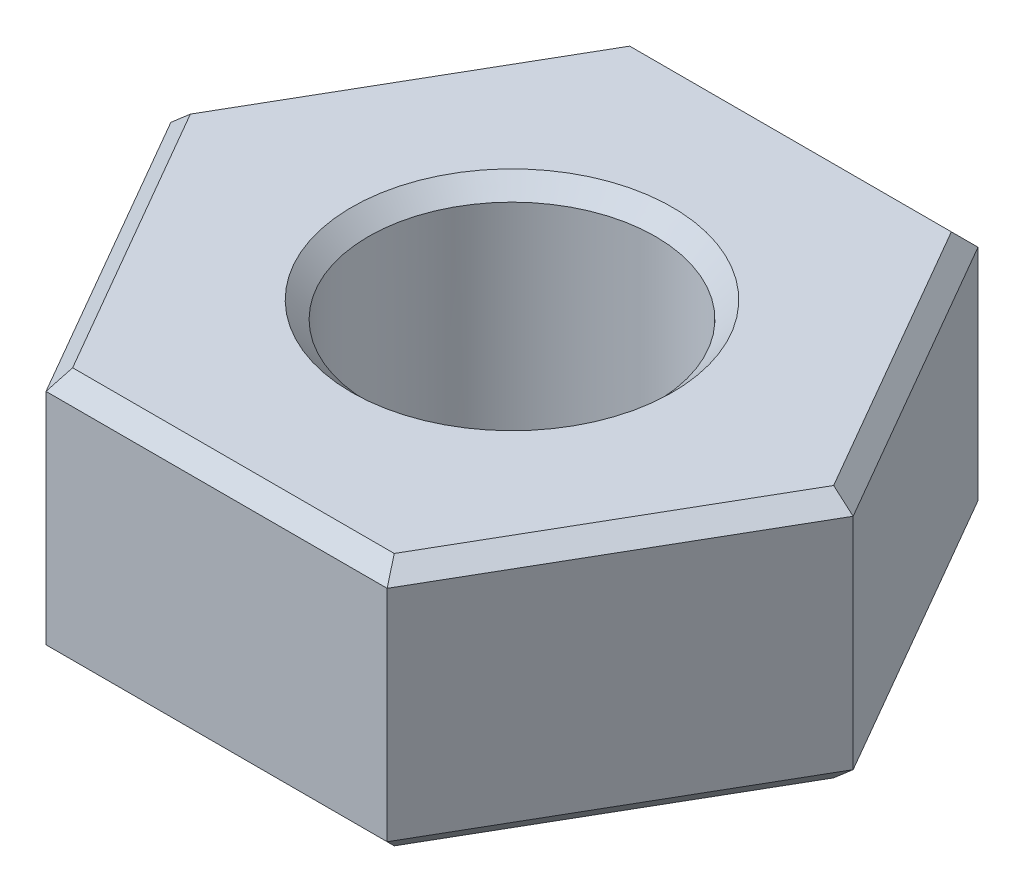
ISO-10303-21;
HEADER;
FILE_DESCRIPTION(('STEP AP214'),'2;1');
FILE_NAME('part.step','',(''),(''),'','','');
FILE_SCHEMA(('AUTOMOTIVE_DESIGN { 1 0 10303 214 1 1 1 1 }'));
ENDSEC;
DATA;
#1=APPLICATION_CONTEXT('core data for automotive mechanical design processes');
#2=APPLICATION_PROTOCOL_DEFINITION('international standard','automotive_design',2000,#1);
#3=PRODUCT_CONTEXT('',#1,'mechanical');
#4=PRODUCT('Part','Part','',(#3));
#5=PRODUCT_RELATED_PRODUCT_CATEGORY('part','',(#4));
#6=PRODUCT_DEFINITION_FORMATION('','',#4);
#7=PRODUCT_DEFINITION_CONTEXT('part definition',#1,'design');
#8=PRODUCT_DEFINITION('design','',#6,#7);
#9=PRODUCT_DEFINITION_SHAPE('','',#8);
#10=(LENGTH_UNIT() NAMED_UNIT(*) SI_UNIT(.MILLI.,.METRE.));
#11=(NAMED_UNIT(*) PLANE_ANGLE_UNIT() SI_UNIT($,.RADIAN.));
#12=(NAMED_UNIT(*) SI_UNIT($,.STERADIAN.) SOLID_ANGLE_UNIT());
#13=UNCERTAINTY_MEASURE_WITH_UNIT(LENGTH_MEASURE(1.E-05),#10,'distance_accuracy_value','');
#14=(GEOMETRIC_REPRESENTATION_CONTEXT(3) GLOBAL_UNCERTAINTY_ASSIGNED_CONTEXT((#13)) GLOBAL_UNIT_ASSIGNED_CONTEXT((#10,
#11,#12)) REPRESENTATION_CONTEXT('',''));
#15=CARTESIAN_POINT('',(0.,0.,0.));
#16=DIRECTION('',(0.,0.,1.));
#17=DIRECTION('',(1.,0.,0.));
#18=AXIS2_PLACEMENT_3D('',#15,#16,#17);
#19=CARTESIAN_POINT('',(4.04145188432738,0.,0.));
#20=DIRECTION('',(0.,1.,0.));
#21=DIRECTION('',(0.,0.,1.));
#22=AXIS2_PLACEMENT_3D('',#19,#20,#21);
#23=PLANE('',#22);
#24=CARTESIAN_POINT('',(0.,0.,0.));
#25=DIRECTION('',(0.,-1.,0.));
#26=DIRECTION('',(0.,0.,-1.));
#27=AXIS2_PLACEMENT_3D('',#24,#25,#26);
#28=CIRCLE('',#27,1.90000000003465);
#29=CARTESIAN_POINT('',(0.,0.,-1.90000000003465));
#30=VERTEX_POINT('',#29);
#31=EDGE_CURVE('E20',#30,#30,#28,.F.);
#32=ORIENTED_EDGE('',*,*,#31,.T.);
#33=EDGE_LOOP('',(#32));
#34=FACE_BOUND('',#33,.T.);
#35=DIRECTION('',(-0.5,0.,0.866025403784439));
#36=VECTOR('',#35,1.);
#37=CARTESIAN_POINT('',(3.81051177665153,0.,0.));
#38=LINE('',#37,#36);
#39=CARTESIAN_POINT('',(3.81051177665153,0.,0.));
#40=VERTEX_POINT('',#39);
#41=CARTESIAN_POINT('',(1.90525588832576,0.,3.3));
#42=VERTEX_POINT('',#41);
#43=EDGE_CURVE('E139',#40,#42,#38,.T.);
#44=ORIENTED_EDGE('',*,*,#43,.T.);
#45=DIRECTION('',(1.,0.,0.));
#46=VECTOR('',#45,1.);
#47=CARTESIAN_POINT('',(-2.02072594216369,0.,3.3));
#48=LINE('',#47,#46);
#49=CARTESIAN_POINT('',(-1.90525588832576,0.,3.3));
#50=VERTEX_POINT('',#49);
#51=EDGE_CURVE('E135',#42,#50,#48,.F.);
#52=ORIENTED_EDGE('',*,*,#51,.T.);
#53=DIRECTION('',(-0.5,0.,-0.866025403784439));
#54=VECTOR('',#53,1.);
#55=CARTESIAN_POINT('',(-1.90525588832576,0.,3.3));
#56=LINE('',#55,#54);
#57=CARTESIAN_POINT('',(-3.81051177665153,0.,0.));
#58=VERTEX_POINT('',#57);
#59=EDGE_CURVE('E112',#50,#58,#56,.T.);
#60=ORIENTED_EDGE('',*,*,#59,.T.);
#61=DIRECTION('',(0.5,0.,-0.866025403784439));
#62=VECTOR('',#61,1.);
#63=CARTESIAN_POINT('',(-3.81051177665153,0.,0.));
#64=LINE('',#63,#62);
#65=CARTESIAN_POINT('',(-1.90525588832576,0.,-3.3));
#66=VERTEX_POINT('',#65);
#67=EDGE_CURVE('E103',#58,#66,#64,.T.);
#68=ORIENTED_EDGE('',*,*,#67,.T.);
#69=DIRECTION('',(1.,0.,0.));
#70=VECTOR('',#69,1.);
#71=CARTESIAN_POINT('',(2.02072594216369,0.,-3.3));
#72=LINE('',#71,#70);
#73=CARTESIAN_POINT('',(1.90525588832576,0.,-3.3));
#74=VERTEX_POINT('',#73);
#75=EDGE_CURVE('E109',#66,#74,#72,.T.);
#76=ORIENTED_EDGE('',*,*,#75,.T.);
#77=DIRECTION('',(0.5,0.,0.866025403784439));
#78=VECTOR('',#77,1.);
#79=CARTESIAN_POINT('',(1.90525588832576,0.,-3.3));
#80=LINE('',#79,#78);
#81=EDGE_CURVE('E144',#74,#40,#80,.T.);
#82=ORIENTED_EDGE('',*,*,#81,.T.);
#83=EDGE_LOOP('',(#44,#52,#60,#68,#76,#82));
#84=FACE_BOUND('',#83,.T.);
#85=ADVANCED_FACE('F17',(#34,#84),#23,.F.);
#86=CARTESIAN_POINT('',(2.02072594216369,0.200000000000001,-3.5));
#87=DIRECTION('',(0.,0.707106781186551,0.707106781186544));
#88=DIRECTION('',(0.,-0.707106781186544,0.707106781186551));
#89=AXIS2_PLACEMENT_3D('',#86,#87,#88);
#90=PLANE('',#89);
#91=DIRECTION('',(-0.377964473009231,-0.654653670707974,0.654653670707978));
#92=VECTOR('',#91,1.);
#93=CARTESIAN_POINT('',(2.02072594216369,0.2,-3.5));
#94=LINE('',#93,#92);
#95=CARTESIAN_POINT('',(2.02072594216369,0.200000000000001,-3.5));
#96=VERTEX_POINT('',#95);
#97=EDGE_CURVE('E120',#96,#74,#94,.T.);
#98=ORIENTED_EDGE('',*,*,#97,.T.);
#99=ORIENTED_EDGE('',*,*,#75,.F.);
#100=DIRECTION('',(-0.377964473009228,0.654653670707975,-0.654653670707979));
#101=VECTOR('',#100,1.);
#102=CARTESIAN_POINT('',(-1.90525588832576,0.,-3.3));
#103=LINE('',#102,#101);
#104=CARTESIAN_POINT('',(-2.02072594216369,0.2,-3.5));
#105=VERTEX_POINT('',#104);
#106=EDGE_CURVE('E114',#66,#105,#103,.T.);
#107=ORIENTED_EDGE('',*,*,#106,.T.);
#108=DIRECTION('',(1.,0.,0.));
#109=VECTOR('',#108,1.);
#110=CARTESIAN_POINT('',(2.02072594216369,0.200000000000001,-3.5));
#111=LINE('',#110,#109);
#112=EDGE_CURVE('E151',#105,#96,#111,.T.);
#113=ORIENTED_EDGE('',*,*,#112,.T.);
#114=EDGE_LOOP('',(#98,#99,#107,#113));
#115=FACE_BOUND('',#114,.T.);
#116=ADVANCED_FACE('F117',(#115),#90,.F.);
#117=CARTESIAN_POINT('',(-2.02072594216369,0.200000000000001,-3.5));
#118=DIRECTION('',(0.612372435695792,0.70710678118655,0.353553390593272));
#119=DIRECTION('',(-0.755928946018457,0.654653670707974,0.));
#120=AXIS2_PLACEMENT_3D('',#117,#118,#119);
#121=PLANE('',#120);
#122=ORIENTED_EDGE('',*,*,#106,.F.);
#123=ORIENTED_EDGE('',*,*,#67,.F.);
#124=DIRECTION('',(-0.755928946018457,0.654653670707974,0.));
#125=VECTOR('',#124,1.);
#126=CARTESIAN_POINT('',(-4.04145188432738,0.200000000000001,0.));
#127=LINE('',#126,#125);
#128=CARTESIAN_POINT('',(-4.04145188432738,0.200000000000001,0.));
#129=VERTEX_POINT('',#128);
#130=EDGE_CURVE('E128',#58,#129,#127,.T.);
#131=ORIENTED_EDGE('',*,*,#130,.T.);
#132=DIRECTION('',(0.5,0.,-0.866025403784439));
#133=VECTOR('',#132,1.);
#134=CARTESIAN_POINT('',(-2.02072594216369,0.200000000000001,-3.5));
#135=LINE('',#134,#133);
#136=EDGE_CURVE('E126',#129,#105,#135,.T.);
#137=ORIENTED_EDGE('',*,*,#136,.T.);
#138=EDGE_LOOP('',(#122,#123,#131,#137));
#139=FACE_BOUND('',#138,.T.);
#140=ADVANCED_FACE('F124',(#139),#121,.F.);
#141=CARTESIAN_POINT('',(-4.04145188432738,0.200000000000001,0.));
#142=DIRECTION('',(0.612372435695792,0.707106781186551,-0.353553390593272));
#143=DIRECTION('',(-0.755928946018457,0.654653670707974,0.));
#144=AXIS2_PLACEMENT_3D('',#141,#142,#143);
#145=PLANE('',#144);
#146=DIRECTION('',(-0.377964473009229,0.654653670707973,0.65465367070798));
#147=VECTOR('',#146,1.);
#148=CARTESIAN_POINT('',(-1.90525588832576,0.,3.3));
#149=LINE('',#148,#147);
#150=CARTESIAN_POINT('',(-2.02072594216369,0.2,3.5));
#151=VERTEX_POINT('',#150);
#152=EDGE_CURVE('E133',#50,#151,#149,.T.);
#153=ORIENTED_EDGE('',*,*,#152,.T.);
#154=DIRECTION('',(-0.5,0.,-0.866025403784439));
#155=VECTOR('',#154,1.);
#156=CARTESIAN_POINT('',(-4.04145188432738,0.2,0.));
#157=LINE('',#156,#155);
#158=EDGE_CURVE('E158',#151,#129,#157,.T.);
#159=ORIENTED_EDGE('',*,*,#158,.T.);
#160=ORIENTED_EDGE('',*,*,#130,.F.);
#161=ORIENTED_EDGE('',*,*,#59,.F.);
#162=EDGE_LOOP('',(#153,#159,#160,#161));
#163=FACE_BOUND('',#162,.T.);
#164=ADVANCED_FACE('F298',(#163),#145,.F.);
#165=CARTESIAN_POINT('',(-2.02072594216369,0.200000000000001,3.5));
#166=DIRECTION('',(0.,0.707106781186551,-0.707106781186544));
#167=DIRECTION('',(0.,0.707106781186544,0.707106781186551));
#168=AXIS2_PLACEMENT_3D('',#165,#166,#167);
#169=PLANE('',#168);
#170=DIRECTION('',(0.37796447300923,0.654653670707973,0.65465367070798));
#171=VECTOR('',#170,1.);
#172=CARTESIAN_POINT('',(1.90525588832576,0.,3.3));
#173=LINE('',#172,#171);
#174=CARTESIAN_POINT('',(2.02072594216369,0.200000000000001,3.5));
#175=VERTEX_POINT('',#174);
#176=EDGE_CURVE('E137',#42,#175,#173,.T.);
#177=ORIENTED_EDGE('',*,*,#176,.T.);
#178=DIRECTION('',(-1.,0.,0.));
#179=VECTOR('',#178,1.);
#180=CARTESIAN_POINT('',(-2.02072594216369,0.200000000000001,3.5));
#181=LINE('',#180,#179);
#182=EDGE_CURVE('E163',#175,#151,#181,.T.);
#183=ORIENTED_EDGE('',*,*,#182,.T.);
#184=ORIENTED_EDGE('',*,*,#152,.F.);
#185=ORIENTED_EDGE('',*,*,#51,.F.);
#186=EDGE_LOOP('',(#177,#183,#184,#185));
#187=FACE_BOUND('',#186,.T.);
#188=ADVANCED_FACE('F303',(#187),#169,.F.);
#189=CARTESIAN_POINT('',(2.02072594216369,0.200000000000001,3.5));
#190=DIRECTION('',(-0.612372435695791,0.707106781186552,-0.353553390593271));
#191=DIRECTION('',(-0.755928946018458,-0.654653670707973,0.));
#192=AXIS2_PLACEMENT_3D('',#189,#190,#191);
#193=PLANE('',#192);
#194=DIRECTION('',(-0.755928946018458,-0.654653670707974,0.));
#195=VECTOR('',#194,1.);
#196=CARTESIAN_POINT('',(4.04145188432738,0.200000000000001,0.));
#197=LINE('',#196,#195);
#198=CARTESIAN_POINT('',(4.04145188432738,0.200000000000001,0.));
#199=VERTEX_POINT('',#198);
#200=EDGE_CURVE('E141',#40,#199,#197,.F.);
#201=ORIENTED_EDGE('',*,*,#200,.T.);
#202=DIRECTION('',(-0.5,0.,0.866025403784439));
#203=VECTOR('',#202,1.);
#204=CARTESIAN_POINT('',(2.02072594216369,0.200000000000001,3.5));
#205=LINE('',#204,#203);
#206=EDGE_CURVE('E168',#199,#175,#205,.T.);
#207=ORIENTED_EDGE('',*,*,#206,.T.);
#208=ORIENTED_EDGE('',*,*,#176,.F.);
#209=ORIENTED_EDGE('',*,*,#43,.F.);
#210=EDGE_LOOP('',(#201,#207,#208,#209));
#211=FACE_BOUND('',#210,.T.);
#212=ADVANCED_FACE('F307',(#211),#193,.F.);
#213=CARTESIAN_POINT('',(4.04145188432738,0.200000000000001,0.));
#214=DIRECTION('',(-0.612372435695792,0.707106781186551,0.353553390593272));
#215=DIRECTION('',(-0.755928946018458,-0.654653670707974,0.));
#216=AXIS2_PLACEMENT_3D('',#213,#214,#215);
#217=PLANE('',#216);
#218=ORIENTED_EDGE('',*,*,#97,.F.);
#219=DIRECTION('',(0.5,0.,0.866025403784438));
#220=VECTOR('',#219,1.);
#221=CARTESIAN_POINT('',(4.04145188432738,0.200000000000001,0.));
#222=LINE('',#221,#220);
#223=EDGE_CURVE('E150',#96,#199,#222,.T.);
#224=ORIENTED_EDGE('',*,*,#223,.T.);
#225=ORIENTED_EDGE('',*,*,#200,.F.);
#226=ORIENTED_EDGE('',*,*,#81,.F.);
#227=EDGE_LOOP('',(#218,#224,#225,#226));
#228=FACE_BOUND('',#227,.T.);
#229=ADVANCED_FACE('F286',(#228),#217,.F.);
#230=CARTESIAN_POINT('',(0.,0.,0.));
#231=DIRECTION('',(0.,-1.,0.));
#232=DIRECTION('',(0.,0.,-1.));
#233=AXIS2_PLACEMENT_3D('',#230,#231,#232);
#234=CONICAL_SURFACE('',#233,1.90000000003465,0.785398163539557);
#235=CARTESIAN_POINT('',(0.,0.200000000000002,0.));
#236=DIRECTION('',(0.,-1.,0.));
#237=DIRECTION('',(0.,0.,-1.));
#238=AXIS2_PLACEMENT_3D('',#235,#236,#237);
#239=CIRCLE('',#238,1.7);
#240=CARTESIAN_POINT('',(0.,0.200000000000002,-1.7));
#241=VERTEX_POINT('',#240);
#242=EDGE_CURVE('E146',#241,#241,#239,.F.);
#243=ORIENTED_EDGE('',*,*,#242,.T.);
#244=EDGE_LOOP('',(#243));
#245=FACE_BOUND('',#244,.T.);
#246=ORIENTED_EDGE('',*,*,#31,.F.);
#247=EDGE_LOOP('',(#246));
#248=FACE_BOUND('',#247,.T.);
#249=ADVANCED_FACE('F282',(#245,#248),#234,.F.);
#250=CARTESIAN_POINT('',(2.02072594216369,3.,-3.5));
#251=DIRECTION('',(0.,0.,1.));
#252=DIRECTION('',(1.,0.,0.));
#253=AXIS2_PLACEMENT_3D('',#250,#251,#252);
#254=PLANE('',#253);
#255=DIRECTION('',(0.,1.,0.));
#256=VECTOR('',#255,1.);
#257=CARTESIAN_POINT('',(-2.02072594216369,3.,-3.5));
#258=LINE('',#257,#256);
#259=CARTESIAN_POINT('',(-2.02072594216369,2.8,-3.5));
#260=VERTEX_POINT('',#259);
#261=EDGE_CURVE('E153',#105,#260,#258,.T.);
#262=ORIENTED_EDGE('',*,*,#261,.T.);
#263=DIRECTION('',(1.,0.,0.));
#264=VECTOR('',#263,1.);
#265=CARTESIAN_POINT('',(4.04145188432738,2.8,-3.5));
#266=LINE('',#265,#264);
#267=CARTESIAN_POINT('',(2.02072594216369,2.8,-3.5));
#268=VERTEX_POINT('',#267);
#269=EDGE_CURVE('E149',#268,#260,#266,.F.);
#270=ORIENTED_EDGE('',*,*,#269,.F.);
#271=DIRECTION('',(0.,1.,0.));
#272=VECTOR('',#271,1.);
#273=CARTESIAN_POINT('',(2.02072594216369,3.,-3.5));
#274=LINE('',#273,#272);
#275=EDGE_CURVE('E173',#268,#96,#274,.F.);
#276=ORIENTED_EDGE('',*,*,#275,.T.);
#277=ORIENTED_EDGE('',*,*,#112,.F.);
#278=EDGE_LOOP('',(#262,#270,#276,#277));
#279=FACE_BOUND('',#278,.T.);
#280=ADVANCED_FACE('F285',(#279),#254,.F.);
#281=CARTESIAN_POINT('',(-2.02072594216369,3.,-3.5));
#282=DIRECTION('',(0.866025403784439,0.,0.5));
#283=DIRECTION('',(0.5,0.,-0.866025403784439));
#284=AXIS2_PLACEMENT_3D('',#281,#282,#283);
#285=PLANE('',#284);
#286=DIRECTION('',(0.,1.,0.));
#287=VECTOR('',#286,1.);
#288=CARTESIAN_POINT('',(-4.04145188432738,3.,0.));
#289=LINE('',#288,#287);
#290=CARTESIAN_POINT('',(-4.04145188432738,2.8,0.));
#291=VERTEX_POINT('',#290);
#292=EDGE_CURVE('E156',#129,#291,#289,.T.);
#293=ORIENTED_EDGE('',*,*,#292,.T.);
#294=DIRECTION('',(-0.5,0.,0.866025403784439));
#295=VECTOR('',#294,1.);
#296=CARTESIAN_POINT('',(-2.02072594216369,2.8,-3.5));
#297=LINE('',#296,#295);
#298=EDGE_CURVE('E188',#260,#291,#297,.T.);
#299=ORIENTED_EDGE('',*,*,#298,.F.);
#300=ORIENTED_EDGE('',*,*,#261,.F.);
#301=ORIENTED_EDGE('',*,*,#136,.F.);
#302=EDGE_LOOP('',(#293,#299,#300,#301));
#303=FACE_BOUND('',#302,.T.);
#304=ADVANCED_FACE('F317',(#303),#285,.F.);
#305=CARTESIAN_POINT('',(-4.04145188432738,3.,0.));
#306=DIRECTION('',(0.866025403784439,0.,-0.5));
#307=DIRECTION('',(-0.5,0.,-0.866025403784439));
#308=AXIS2_PLACEMENT_3D('',#305,#306,#307);
#309=PLANE('',#308);
#310=DIRECTION('',(0.,1.,0.));
#311=VECTOR('',#310,1.);
#312=CARTESIAN_POINT('',(-2.02072594216369,3.,3.5));
#313=LINE('',#312,#311);
#314=CARTESIAN_POINT('',(-2.02072594216369,2.8,3.5));
#315=VERTEX_POINT('',#314);
#316=EDGE_CURVE('E161',#151,#315,#313,.T.);
#317=ORIENTED_EDGE('',*,*,#316,.T.);
#318=DIRECTION('',(0.5,0.,0.866025403784438));
#319=VECTOR('',#318,1.);
#320=CARTESIAN_POINT('',(-4.04145188432738,2.8,0.));
#321=LINE('',#320,#319);
#322=EDGE_CURVE('E194',#291,#315,#321,.T.);
#323=ORIENTED_EDGE('',*,*,#322,.F.);
#324=ORIENTED_EDGE('',*,*,#292,.F.);
#325=ORIENTED_EDGE('',*,*,#158,.F.);
#326=EDGE_LOOP('',(#317,#323,#324,#325));
#327=FACE_BOUND('',#326,.T.);
#328=ADVANCED_FACE('F321',(#327),#309,.F.);
#329=CARTESIAN_POINT('',(-2.02072594216369,3.,3.5));
#330=DIRECTION('',(0.,0.,-1.));
#331=DIRECTION('',(-1.,0.,0.));
#332=AXIS2_PLACEMENT_3D('',#329,#330,#331);
#333=PLANE('',#332);
#334=DIRECTION('',(0.,1.,0.));
#335=VECTOR('',#334,1.);
#336=CARTESIAN_POINT('',(2.02072594216369,3.,3.5));
#337=LINE('',#336,#335);
#338=CARTESIAN_POINT('',(2.02072594216369,2.8,3.5));
#339=VERTEX_POINT('',#338);
#340=EDGE_CURVE('E166',#175,#339,#337,.T.);
#341=ORIENTED_EDGE('',*,*,#340,.T.);
#342=DIRECTION('',(1.,0.,0.));
#343=VECTOR('',#342,1.);
#344=CARTESIAN_POINT('',(4.04145188432738,2.8,3.5));
#345=LINE('',#344,#343);
#346=EDGE_CURVE('E200',#315,#339,#345,.T.);
#347=ORIENTED_EDGE('',*,*,#346,.F.);
#348=ORIENTED_EDGE('',*,*,#316,.F.);
#349=ORIENTED_EDGE('',*,*,#182,.F.);
#350=EDGE_LOOP('',(#341,#347,#348,#349));
#351=FACE_BOUND('',#350,.T.);
#352=ADVANCED_FACE('F325',(#351),#333,.F.);
#353=CARTESIAN_POINT('',(2.02072594216369,3.,3.5));
#354=DIRECTION('',(-0.866025403784439,0.,-0.5));
#355=DIRECTION('',(-0.5,0.,0.866025403784439));
#356=AXIS2_PLACEMENT_3D('',#353,#354,#355);
#357=PLANE('',#356);
#358=DIRECTION('',(0.,1.,0.));
#359=VECTOR('',#358,1.);
#360=CARTESIAN_POINT('',(4.04145188432738,3.,0.));
#361=LINE('',#360,#359);
#362=CARTESIAN_POINT('',(4.04145188432738,2.8,0.));
#363=VERTEX_POINT('',#362);
#364=EDGE_CURVE('E171',#199,#363,#361,.T.);
#365=ORIENTED_EDGE('',*,*,#364,.T.);
#366=DIRECTION('',(0.5,0.,-0.866025403784439));
#367=VECTOR('',#366,1.);
#368=CARTESIAN_POINT('',(2.02072594216369,2.8,3.5));
#369=LINE('',#368,#367);
#370=EDGE_CURVE('E206',#339,#363,#369,.T.);
#371=ORIENTED_EDGE('',*,*,#370,.F.);
#372=ORIENTED_EDGE('',*,*,#340,.F.);
#373=ORIENTED_EDGE('',*,*,#206,.F.);
#374=EDGE_LOOP('',(#365,#371,#372,#373));
#375=FACE_BOUND('',#374,.T.);
#376=ADVANCED_FACE('F329',(#375),#357,.F.);
#377=CARTESIAN_POINT('',(4.04145188432738,3.,0.));
#378=DIRECTION('',(-0.866025403784438,0.,0.5));
#379=DIRECTION('',(0.5,0.,0.866025403784438));
#380=AXIS2_PLACEMENT_3D('',#377,#378,#379);
#381=PLANE('',#380);
#382=ORIENTED_EDGE('',*,*,#275,.F.);
#383=DIRECTION('',(-0.5,0.,-0.866025403784438));
#384=VECTOR('',#383,1.);
#385=CARTESIAN_POINT('',(4.04145188432738,2.8,0.));
#386=LINE('',#385,#384);
#387=EDGE_CURVE('E209',#363,#268,#386,.T.);
#388=ORIENTED_EDGE('',*,*,#387,.F.);
#389=ORIENTED_EDGE('',*,*,#364,.F.);
#390=ORIENTED_EDGE('',*,*,#223,.F.);
#391=EDGE_LOOP('',(#382,#388,#389,#390));
#392=FACE_BOUND('',#391,.T.);
#393=ADVANCED_FACE('F278',(#392),#381,.F.);
#394=CARTESIAN_POINT('',(0.,3.,0.));
#395=DIRECTION('',(0.,-1.,0.));
#396=DIRECTION('',(0.,0.,-1.));
#397=AXIS2_PLACEMENT_3D('',#394,#395,#396);
#398=CYLINDRICAL_SURFACE('',#397,1.7);
#399=CARTESIAN_POINT('',(0.,2.80000000003611,0.));
#400=DIRECTION('',(0.,1.,0.));
#401=DIRECTION('',(-1.,0.,0.));
#402=AXIS2_PLACEMENT_3D('',#399,#400,#401);
#403=CIRCLE('',#402,1.70000000002801);
#404=CARTESIAN_POINT('',(-1.70000000002801,2.80000000003611,0.));
#405=VERTEX_POINT('',#404);
#406=EDGE_CURVE('E178',#405,#405,#403,.T.);
#407=ORIENTED_EDGE('',*,*,#406,.T.);
#408=EDGE_LOOP('',(#407));
#409=FACE_BOUND('',#408,.T.);
#410=ORIENTED_EDGE('',*,*,#242,.F.);
#411=EDGE_LOOP('',(#410));
#412=FACE_BOUND('',#411,.T.);
#413=ADVANCED_FACE('F275',(#409,#412),#398,.F.);
#414=CARTESIAN_POINT('',(4.04145188432738,3.,-3.3));
#415=DIRECTION('',(0.,0.707106781186545,-0.70710678118655));
#416=DIRECTION('',(0.,0.70710678118655,0.707106781186545));
#417=AXIS2_PLACEMENT_3D('',#414,#415,#416);
#418=PLANE('',#417);
#419=DIRECTION('',(-0.377964473009227,0.65465367070798,0.654653670707974));
#420=VECTOR('',#419,1.);
#421=CARTESIAN_POINT('',(2.02072594216369,2.8,-3.5));
#422=LINE('',#421,#420);
#423=CARTESIAN_POINT('',(1.90525588832577,3.,-3.3));
#424=VERTEX_POINT('',#423);
#425=EDGE_CURVE('E182',#268,#424,#422,.T.);
#426=ORIENTED_EDGE('',*,*,#425,.F.);
#427=ORIENTED_EDGE('',*,*,#269,.T.);
#428=DIRECTION('',(-0.377964473009223,-0.654653670707979,-0.654653670707978));
#429=VECTOR('',#428,1.);
#430=CARTESIAN_POINT('',(-1.90525588832577,3.,-3.3));
#431=LINE('',#430,#429);
#432=CARTESIAN_POINT('',(-1.90525588832577,3.,-3.3));
#433=VERTEX_POINT('',#432);
#434=EDGE_CURVE('E185',#433,#260,#431,.T.);
#435=ORIENTED_EDGE('',*,*,#434,.F.);
#436=DIRECTION('',(1.,0.,0.));
#437=VECTOR('',#436,1.);
#438=CARTESIAN_POINT('',(4.04145188432738,3.,-3.3));
#439=LINE('',#438,#437);
#440=EDGE_CURVE('E181',#424,#433,#439,.F.);
#441=ORIENTED_EDGE('',*,*,#440,.F.);
#442=EDGE_LOOP('',(#426,#427,#435,#441));
#443=FACE_BOUND('',#442,.T.);
#444=ADVANCED_FACE('F236',(#443),#418,.T.);
#445=CARTESIAN_POINT('',(-1.8475208614068,3.,-3.4));
#446=DIRECTION('',(-0.612372435695797,0.707106781186544,-0.353553390593275));
#447=DIRECTION('',(-0.755928946018452,-0.654653670707981,0.));
#448=AXIS2_PLACEMENT_3D('',#445,#446,#447);
#449=PLANE('',#448);
#450=ORIENTED_EDGE('',*,*,#434,.T.);
#451=ORIENTED_EDGE('',*,*,#298,.T.);
#452=DIRECTION('',(-0.75592894601845,-0.654653670707982,0.));
#453=VECTOR('',#452,1.);
#454=CARTESIAN_POINT('',(-2.68880268222599,3.97142857142857,0.));
#455=LINE('',#454,#453);
#456=CARTESIAN_POINT('',(-3.81051177665153,3.,0.));
#457=VERTEX_POINT('',#456);
#458=EDGE_CURVE('E191',#457,#291,#455,.T.);
#459=ORIENTED_EDGE('',*,*,#458,.F.);
#460=DIRECTION('',(-0.5,0.,0.866025403784439));
#461=VECTOR('',#460,1.);
#462=CARTESIAN_POINT('',(-1.90525588832577,3.,-3.3));
#463=LINE('',#462,#461);
#464=EDGE_CURVE('E216',#433,#457,#463,.T.);
#465=ORIENTED_EDGE('',*,*,#464,.F.);
#466=EDGE_LOOP('',(#450,#451,#459,#465));
#467=FACE_BOUND('',#466,.T.);
#468=ADVANCED_FACE('F240',(#467),#449,.T.);
#469=CARTESIAN_POINT('',(-1.8475208614068,3.,3.4));
#470=DIRECTION('',(-0.612372435695798,0.707106781186543,0.353553390593276));
#471=DIRECTION('',(-0.75592894601845,-0.654653670707982,0.));
#472=AXIS2_PLACEMENT_3D('',#469,#470,#471);
#473=PLANE('',#472);
#474=ORIENTED_EDGE('',*,*,#458,.T.);
#475=ORIENTED_EDGE('',*,*,#322,.T.);
#476=DIRECTION('',(-0.37796447300922,-0.654653670707981,0.654653670707978));
#477=VECTOR('',#476,1.);
#478=CARTESIAN_POINT('',(-1.90525588832577,3.,3.3));
#479=LINE('',#478,#477);
#480=CARTESIAN_POINT('',(-1.90525588832577,3.,3.3));
#481=VERTEX_POINT('',#480);
#482=EDGE_CURVE('E197',#481,#315,#479,.T.);
#483=ORIENTED_EDGE('',*,*,#482,.F.);
#484=DIRECTION('',(0.5,0.,0.866025403784439));
#485=VECTOR('',#484,1.);
#486=CARTESIAN_POINT('',(-3.81051177665153,3.,0.));
#487=LINE('',#486,#485);
#488=EDGE_CURVE('E219',#457,#481,#487,.T.);
#489=ORIENTED_EDGE('',*,*,#488,.F.);
#490=EDGE_LOOP('',(#474,#475,#483,#489));
#491=FACE_BOUND('',#490,.T.);
#492=ADVANCED_FACE('F244',(#491),#473,.T.);
#493=CARTESIAN_POINT('',(4.04145188432738,3.,3.3));
#494=DIRECTION('',(0.,0.707106781186545,0.70710678118655));
#495=DIRECTION('',(0.,-0.70710678118655,0.707106781186545));
#496=AXIS2_PLACEMENT_3D('',#493,#494,#495);
#497=PLANE('',#496);
#498=ORIENTED_EDGE('',*,*,#482,.T.);
#499=ORIENTED_EDGE('',*,*,#346,.T.);
#500=DIRECTION('',(0.377964473009229,-0.654653670707981,0.654653670707972));
#501=VECTOR('',#500,1.);
#502=CARTESIAN_POINT('',(1.90525588832577,3.,3.3));
#503=LINE('',#502,#501);
#504=CARTESIAN_POINT('',(1.90525588832577,3.,3.3));
#505=VERTEX_POINT('',#504);
#506=EDGE_CURVE('E203',#505,#339,#503,.T.);
#507=ORIENTED_EDGE('',*,*,#506,.F.);
#508=DIRECTION('',(1.,0.,0.));
#509=VECTOR('',#508,1.);
#510=CARTESIAN_POINT('',(4.04145188432738,3.,3.3));
#511=LINE('',#510,#509);
#512=EDGE_CURVE('E222',#481,#505,#511,.T.);
#513=ORIENTED_EDGE('',*,*,#512,.F.);
#514=EDGE_LOOP('',(#498,#499,#507,#513));
#515=FACE_BOUND('',#514,.T.);
#516=ADVANCED_FACE('F248',(#515),#497,.T.);
#517=CARTESIAN_POINT('',(3.8682468035705,3.,-0.0999999999999997));
#518=DIRECTION('',(0.612372435695797,0.707106781186545,0.353553390593275));
#519=DIRECTION('',(-0.755928946018452,0.65465367070798,0.));
#520=AXIS2_PLACEMENT_3D('',#517,#518,#519);
#521=PLANE('',#520);
#522=DIRECTION('',(-0.755928946018452,0.65465367070798,0.));
#523=VECTOR('',#522,1.);
#524=CARTESIAN_POINT('',(3.84350322060522,2.97142857142857,0.));
#525=LINE('',#524,#523);
#526=CARTESIAN_POINT('',(3.81051177665153,3.,0.));
#527=VERTEX_POINT('',#526);
#528=EDGE_CURVE('E34',#527,#363,#525,.F.);
#529=ORIENTED_EDGE('',*,*,#528,.F.);
#530=DIRECTION('',(0.5,0.,-0.866025403784439));
#531=VECTOR('',#530,1.);
#532=CARTESIAN_POINT('',(1.90525588832577,3.,3.3));
#533=LINE('',#532,#531);
#534=EDGE_CURVE('E225',#505,#527,#533,.T.);
#535=ORIENTED_EDGE('',*,*,#534,.F.);
#536=ORIENTED_EDGE('',*,*,#506,.T.);
#537=ORIENTED_EDGE('',*,*,#370,.T.);
#538=EDGE_LOOP('',(#529,#535,#536,#537));
#539=FACE_BOUND('',#538,.T.);
#540=ADVANCED_FACE('F250',(#539),#521,.T.);
#541=CARTESIAN_POINT('',(3.86824680357049,3.,0.0999999999999978));
#542=DIRECTION('',(0.612372435695796,0.707106781186545,-0.353553390593275));
#543=DIRECTION('',(-0.755928946018452,0.65465367070798,0.));
#544=AXIS2_PLACEMENT_3D('',#541,#542,#543);
#545=PLANE('',#544);
#546=ORIENTED_EDGE('',*,*,#425,.T.);
#547=DIRECTION('',(-0.5,0.,-0.866025403784438));
#548=VECTOR('',#547,1.);
#549=CARTESIAN_POINT('',(3.81051177665153,3.,0.));
#550=LINE('',#549,#548);
#551=EDGE_CURVE('E26',#527,#424,#550,.T.);
#552=ORIENTED_EDGE('',*,*,#551,.F.);
#553=ORIENTED_EDGE('',*,*,#528,.T.);
#554=ORIENTED_EDGE('',*,*,#387,.T.);
#555=EDGE_LOOP('',(#546,#552,#553,#554));
#556=FACE_BOUND('',#555,.T.);
#557=ADVANCED_FACE('F232',(#556),#545,.T.);
#558=CARTESIAN_POINT('',(0.,3.00000000004275,0.));
#559=DIRECTION('',(0.,1.,0.));
#560=DIRECTION('',(0.,0.,1.));
#561=AXIS2_PLACEMENT_3D('',#558,#559,#560);
#562=CONICAL_SURFACE('',#561,1.9000000000915,0.785398163539557);
#563=ORIENTED_EDGE('',*,*,#406,.F.);
#564=EDGE_LOOP('',(#563));
#565=FACE_BOUND('',#564,.T.);
#566=CARTESIAN_POINT('',(0.,2.99999999992906,0.));
#567=DIRECTION('',(0.,1.,0.));
#568=DIRECTION('',(0.,0.,1.));
#569=AXIS2_PLACEMENT_3D('',#566,#567,#568);
#570=CIRCLE('',#569,1.89999999997781);
#571=CARTESIAN_POINT('',(0.,2.99999999992906,1.89999999997781));
#572=VERTEX_POINT('',#571);
#573=EDGE_CURVE('E11',#572,#572,#570,.F.);
#574=ORIENTED_EDGE('',*,*,#573,.F.);
#575=EDGE_LOOP('',(#574));
#576=FACE_BOUND('',#575,.T.);
#577=ADVANCED_FACE('F258',(#565,#576),#562,.F.);
#578=CARTESIAN_POINT('',(4.04145188432738,3.,0.));
#579=DIRECTION('',(0.,1.,0.));
#580=DIRECTION('',(0.,0.,1.));
#581=AXIS2_PLACEMENT_3D('',#578,#579,#580);
#582=PLANE('',#581);
#583=ORIENTED_EDGE('',*,*,#573,.T.);
#584=EDGE_LOOP('',(#583));
#585=FACE_BOUND('',#584,.T.);
#586=ORIENTED_EDGE('',*,*,#534,.T.);
#587=ORIENTED_EDGE('',*,*,#551,.T.);
#588=ORIENTED_EDGE('',*,*,#440,.T.);
#589=ORIENTED_EDGE('',*,*,#464,.T.);
#590=ORIENTED_EDGE('',*,*,#488,.T.);
#591=ORIENTED_EDGE('',*,*,#512,.T.);
#592=EDGE_LOOP('',(#586,#587,#588,#589,#590,#591));
#593=FACE_BOUND('',#592,.T.);
#594=ADVANCED_FACE('F230',(#585,#593),#582,.T.);
#595=CLOSED_SHELL('',(#85,#116,#140,#164,#188,#212,#229,#249,#280,#304,#328,#352,#376,#393,#413,
#444,#468,#492,#516,#540,#557,#577,#594));
#596=MANIFOLD_SOLID_BREP('B1',#595);
#597=ADVANCED_BREP_SHAPE_REPRESENTATION('',(#18,#596),#14);
#598=SHAPE_DEFINITION_REPRESENTATION(#9,#597);
ENDSEC;
END-ISO-10303-21;
